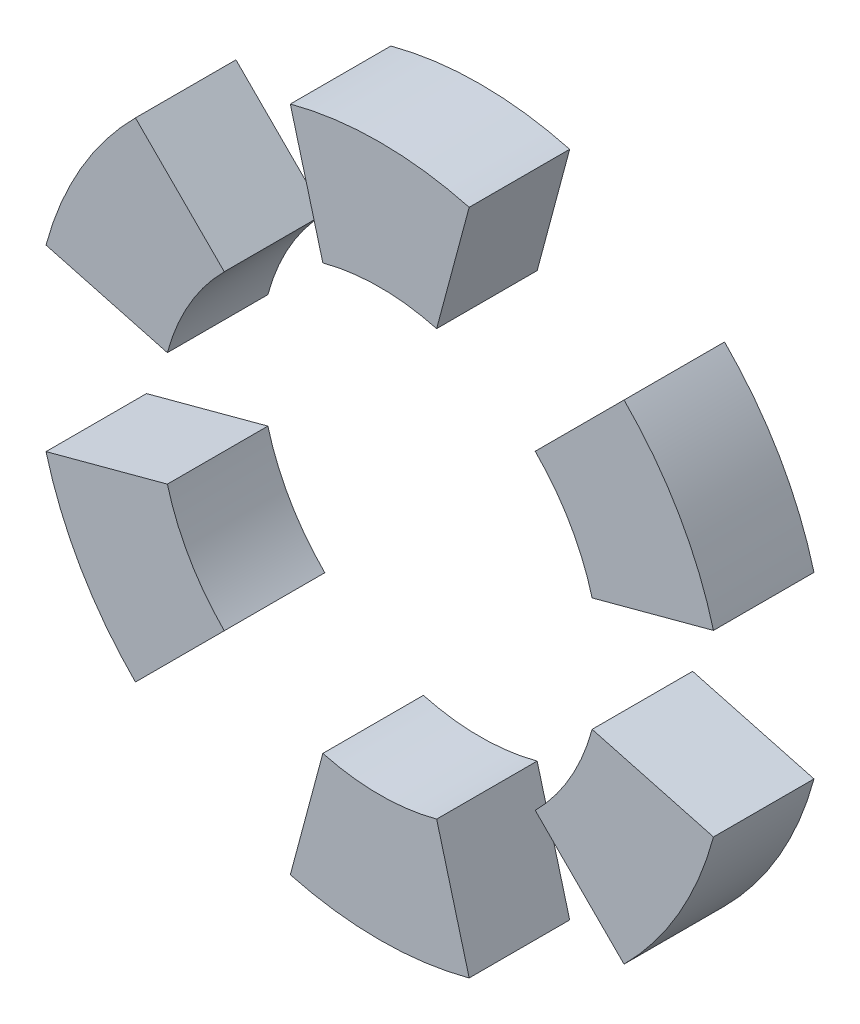
ISO-10303-21;
HEADER;
FILE_DESCRIPTION(('STEP AP214'),'2;1');
FILE_NAME('part.step','',(''),(''),'','','');
FILE_SCHEMA(('AUTOMOTIVE_DESIGN { 1 0 10303 214 1 1 1 1 }'));
ENDSEC;
DATA;
#1=APPLICATION_CONTEXT('core data for automotive mechanical design processes');
#2=APPLICATION_PROTOCOL_DEFINITION('international standard','automotive_design',2000,#1);
#3=PRODUCT_CONTEXT('',#1,'mechanical');
#4=PRODUCT('Part','Part','',(#3));
#5=PRODUCT_RELATED_PRODUCT_CATEGORY('part','',(#4));
#6=PRODUCT_DEFINITION_FORMATION('','',#4);
#7=PRODUCT_DEFINITION_CONTEXT('part definition',#1,'design');
#8=PRODUCT_DEFINITION('design','',#6,#7);
#9=PRODUCT_DEFINITION_SHAPE('','',#8);
#10=(LENGTH_UNIT() NAMED_UNIT(*) SI_UNIT(.MILLI.,.METRE.));
#11=(NAMED_UNIT(*) PLANE_ANGLE_UNIT() SI_UNIT($,.RADIAN.));
#12=(NAMED_UNIT(*) SI_UNIT($,.STERADIAN.) SOLID_ANGLE_UNIT());
#13=UNCERTAINTY_MEASURE_WITH_UNIT(LENGTH_MEASURE(1.E-05),#10,'distance_accuracy_value','');
#14=(GEOMETRIC_REPRESENTATION_CONTEXT(3) GLOBAL_UNCERTAINTY_ASSIGNED_CONTEXT((#13)) GLOBAL_UNIT_ASSIGNED_CONTEXT((#10,
#11,#12)) REPRESENTATION_CONTEXT('',''));
#15=CARTESIAN_POINT('',(0.,0.,0.));
#16=DIRECTION('',(0.,0.,1.));
#17=DIRECTION('',(1.,0.,0.));
#18=AXIS2_PLACEMENT_3D('',#15,#16,#17);
#19=CARTESIAN_POINT('',(0.,0.,8.));
#20=DIRECTION('',(0.,0.,-1.));
#21=DIRECTION('',(-1.,0.,0.));
#22=AXIS2_PLACEMENT_3D('',#19,#20,#21);
#23=CYLINDRICAL_SURFACE('',#22,27.5);
#24=CARTESIAN_POINT('',(0.,0.,0.));
#25=DIRECTION('',(0.,0.,1.));
#26=DIRECTION('',(1.,0.,0.));
#27=AXIS2_PLACEMENT_3D('',#24,#25,#26);
#28=CIRCLE('',#27,27.5);
#29=CARTESIAN_POINT('',(-7.11752374031982,-26.5629602229492,0.));
#30=VERTEX_POINT('',#29);
#31=CARTESIAN_POINT('',(7.11752374031886,-26.5629602229495,0.));
#32=VERTEX_POINT('',#31);
#33=EDGE_CURVE('E113',#30,#32,#28,.T.);
#34=ORIENTED_EDGE('',*,*,#33,.T.);
#35=DIRECTION('',(0.,0.,-1.));
#36=VECTOR('',#35,1.);
#37=CARTESIAN_POINT('',(7.11752374031886,-26.5629602229495,8.));
#38=LINE('',#37,#36);
#39=CARTESIAN_POINT('',(7.11752374031886,-26.5629602229495,8.));
#40=VERTEX_POINT('',#39);
#41=EDGE_CURVE('E12',#40,#32,#38,.T.);
#42=ORIENTED_EDGE('',*,*,#41,.F.);
#43=CARTESIAN_POINT('',(0.,0.,8.));
#44=DIRECTION('',(0.,0.,1.));
#45=DIRECTION('',(1.,0.,0.));
#46=AXIS2_PLACEMENT_3D('',#43,#44,#45);
#47=CIRCLE('',#46,27.5);
#48=CARTESIAN_POINT('',(-7.11752374031982,-26.5629602229492,8.));
#49=VERTEX_POINT('',#48);
#50=EDGE_CURVE('E101',#49,#40,#47,.T.);
#51=ORIENTED_EDGE('',*,*,#50,.F.);
#52=DIRECTION('',(0.,0.,-1.));
#53=VECTOR('',#52,1.);
#54=CARTESIAN_POINT('',(-7.11752374031982,-26.5629602229492,8.));
#55=LINE('',#54,#53);
#56=EDGE_CURVE('E109',#49,#30,#55,.T.);
#57=ORIENTED_EDGE('',*,*,#56,.T.);
#58=EDGE_LOOP('',(#34,#42,#51,#57));
#59=FACE_BOUND('',#58,.T.);
#60=ADVANCED_FACE('F50',(#59),#23,.T.);
#61=CARTESIAN_POINT('',(4.52933328929371,-16.9037019600588,8.));
#62=DIRECTION('',(-0.96592582628907,-0.258819045102515,0.));
#63=DIRECTION('',(0.258819045102515,-0.96592582628907,0.));
#64=AXIS2_PLACEMENT_3D('',#61,#62,#63);
#65=PLANE('',#64);
#66=DIRECTION('',(-0.258819045102515,0.96592582628907,0.));
#67=VECTOR('',#66,1.);
#68=CARTESIAN_POINT('',(4.52933328929371,-16.9037019600588,0.));
#69=LINE('',#68,#67);
#70=CARTESIAN_POINT('',(4.52933328929371,-16.9037019600588,0.));
#71=VERTEX_POINT('',#70);
#72=EDGE_CURVE('E105',#32,#71,#69,.T.);
#73=ORIENTED_EDGE('',*,*,#72,.T.);
#74=DIRECTION('',(0.,0.,-1.));
#75=VECTOR('',#74,1.);
#76=CARTESIAN_POINT('',(4.52933328929371,-16.9037019600588,8.));
#77=LINE('',#76,#75);
#78=CARTESIAN_POINT('',(4.52933328929371,-16.9037019600588,8.));
#79=VERTEX_POINT('',#78);
#80=EDGE_CURVE('E58',#79,#71,#77,.T.);
#81=ORIENTED_EDGE('',*,*,#80,.F.);
#82=DIRECTION('',(-0.258819045102515,0.96592582628907,0.));
#83=VECTOR('',#82,1.);
#84=CARTESIAN_POINT('',(4.52933328929371,-16.9037019600588,8.));
#85=LINE('',#84,#83);
#86=EDGE_CURVE('E96',#40,#79,#85,.T.);
#87=ORIENTED_EDGE('',*,*,#86,.F.);
#88=ORIENTED_EDGE('',*,*,#41,.T.);
#89=EDGE_LOOP('',(#73,#81,#87,#88));
#90=FACE_BOUND('',#89,.T.);
#91=ADVANCED_FACE('F104',(#90),#65,.F.);
#92=CARTESIAN_POINT('',(0.,0.,8.));
#93=DIRECTION('',(0.,0.,-1.));
#94=DIRECTION('',(-1.,0.,0.));
#95=AXIS2_PLACEMENT_3D('',#92,#93,#94);
#96=CYLINDRICAL_SURFACE('',#95,17.5);
#97=CARTESIAN_POINT('',(0.,0.,0.));
#98=DIRECTION('',(0.,0.,-1.));
#99=DIRECTION('',(1.,0.,0.));
#100=AXIS2_PLACEMENT_3D('',#97,#98,#99);
#101=CIRCLE('',#100,17.5);
#102=CARTESIAN_POINT('',(-4.52933328929454,-16.9037019600586,0.));
#103=VERTEX_POINT('',#102);
#104=EDGE_CURVE('E83',#71,#103,#101,.T.);
#105=ORIENTED_EDGE('',*,*,#104,.T.);
#106=DIRECTION('',(0.,0.,-1.));
#107=VECTOR('',#106,1.);
#108=CARTESIAN_POINT('',(-4.52933328929454,-16.9037019600586,8.));
#109=LINE('',#108,#107);
#110=CARTESIAN_POINT('',(-4.52933328929454,-16.9037019600586,8.));
#111=VERTEX_POINT('',#110);
#112=EDGE_CURVE('E106',#111,#103,#109,.T.);
#113=ORIENTED_EDGE('',*,*,#112,.F.);
#114=CARTESIAN_POINT('',(0.,0.,8.));
#115=DIRECTION('',(0.,0.,-1.));
#116=DIRECTION('',(1.,0.,0.));
#117=AXIS2_PLACEMENT_3D('',#114,#115,#116);
#118=CIRCLE('',#117,17.5);
#119=EDGE_CURVE('E99',#79,#111,#118,.T.);
#120=ORIENTED_EDGE('',*,*,#119,.F.);
#121=ORIENTED_EDGE('',*,*,#80,.T.);
#122=EDGE_LOOP('',(#105,#113,#120,#121));
#123=FACE_BOUND('',#122,.T.);
#124=ADVANCED_FACE('F107',(#123),#96,.F.);
#125=CARTESIAN_POINT('',(-4.52933328929454,-16.9037019600586,8.));
#126=DIRECTION('',(0.965925826289066,-0.258819045102528,0.));
#127=DIRECTION('',(0.258819045102528,0.965925826289066,0.));
#128=AXIS2_PLACEMENT_3D('',#125,#126,#127);
#129=PLANE('',#128);
#130=DIRECTION('',(-0.258819045102528,-0.965925826289066,0.));
#131=VECTOR('',#130,1.);
#132=CARTESIAN_POINT('',(-4.52933328929454,-16.9037019600586,0.));
#133=LINE('',#132,#131);
#134=EDGE_CURVE('E89',#103,#30,#133,.T.);
#135=ORIENTED_EDGE('',*,*,#134,.T.);
#136=ORIENTED_EDGE('',*,*,#56,.F.);
#137=DIRECTION('',(-0.258819045102528,-0.965925826289066,0.));
#138=VECTOR('',#137,1.);
#139=CARTESIAN_POINT('',(-4.52933328929454,-16.9037019600586,8.));
#140=LINE('',#139,#138);
#141=EDGE_CURVE('E66',#111,#49,#140,.T.);
#142=ORIENTED_EDGE('',*,*,#141,.F.);
#143=ORIENTED_EDGE('',*,*,#112,.T.);
#144=EDGE_LOOP('',(#135,#136,#142,#143));
#145=FACE_BOUND('',#144,.T.);
#146=ADVANCED_FACE('F120',(#145),#129,.F.);
#147=CARTESIAN_POINT('',(0.,0.,8.));
#148=DIRECTION('',(0.,0.,1.));
#149=DIRECTION('',(1.,0.,0.));
#150=AXIS2_PLACEMENT_3D('',#147,#148,#149);
#151=PLANE('',#150);
#152=ORIENTED_EDGE('',*,*,#50,.T.);
#153=ORIENTED_EDGE('',*,*,#86,.T.);
#154=ORIENTED_EDGE('',*,*,#119,.T.);
#155=ORIENTED_EDGE('',*,*,#141,.T.);
#156=EDGE_LOOP('',(#152,#153,#154,#155));
#157=FACE_BOUND('',#156,.T.);
#158=ADVANCED_FACE('F97',(#157),#151,.T.);
#159=CARTESIAN_POINT('',(0.,0.,0.));
#160=DIRECTION('',(0.,0.,1.));
#161=DIRECTION('',(1.,0.,0.));
#162=AXIS2_PLACEMENT_3D('',#159,#160,#161);
#163=PLANE('',#162);
#164=ORIENTED_EDGE('',*,*,#33,.F.);
#165=ORIENTED_EDGE('',*,*,#134,.F.);
#166=ORIENTED_EDGE('',*,*,#104,.F.);
#167=ORIENTED_EDGE('',*,*,#72,.F.);
#168=EDGE_LOOP('',(#164,#165,#166,#167));
#169=FACE_BOUND('',#168,.T.);
#170=ADVANCED_FACE('F123',(#169),#163,.F.);
#171=CLOSED_SHELL('',(#60,#91,#124,#146,#158,#170));
#172=MANIFOLD_SOLID_BREP('B2',#171);
#173=CARTESIAN_POINT('',(0.,0.,8.));
#174=DIRECTION('',(0.,0.,-1.));
#175=DIRECTION('',(-1.,0.,0.));
#176=AXIS2_PLACEMENT_3D('',#173,#174,#175);
#177=CYLINDRICAL_SURFACE('',#176,27.5);
#178=CARTESIAN_POINT('',(0.,0.,0.));
#179=DIRECTION('',(0.,0.,1.));
#180=DIRECTION('',(1.,0.,0.));
#181=AXIS2_PLACEMENT_3D('',#178,#179,#180);
#182=CIRCLE('',#181,27.5);
#183=CARTESIAN_POINT('',(19.4454364826295,-19.4454364826307,0.));
#184=VERTEX_POINT('',#183);
#185=CARTESIAN_POINT('',(26.5629602229492,-7.11752374032009,0.));
#186=VERTEX_POINT('',#185);
#187=EDGE_CURVE('E252',#184,#186,#182,.T.);
#188=ORIENTED_EDGE('',*,*,#187,.T.);
#189=DIRECTION('',(0.,0.,-1.));
#190=VECTOR('',#189,1.);
#191=CARTESIAN_POINT('',(26.5629602229492,-7.11752374032009,8.));
#192=LINE('',#191,#190);
#193=CARTESIAN_POINT('',(26.5629602229492,-7.11752374032009,8.));
#194=VERTEX_POINT('',#193);
#195=EDGE_CURVE('E48',#194,#186,#192,.T.);
#196=ORIENTED_EDGE('',*,*,#195,.F.);
#197=CARTESIAN_POINT('',(0.,0.,8.));
#198=DIRECTION('',(0.,0.,1.));
#199=DIRECTION('',(1.,0.,0.));
#200=AXIS2_PLACEMENT_3D('',#197,#198,#199);
#201=CIRCLE('',#200,27.5);
#202=CARTESIAN_POINT('',(19.4454364826295,-19.4454364826307,8.));
#203=VERTEX_POINT('',#202);
#204=EDGE_CURVE('E236',#203,#194,#201,.T.);
#205=ORIENTED_EDGE('',*,*,#204,.F.);
#206=DIRECTION('',(0.,0.,-1.));
#207=VECTOR('',#206,1.);
#208=CARTESIAN_POINT('',(19.4454364826295,-19.4454364826307,8.));
#209=LINE('',#208,#207);
#210=EDGE_CURVE('E248',#203,#184,#209,.T.);
#211=ORIENTED_EDGE('',*,*,#210,.T.);
#212=EDGE_LOOP('',(#188,#196,#205,#211));
#213=FACE_BOUND('',#212,.T.);
#214=ADVANCED_FACE('F184',(#213),#177,.T.);
#215=CARTESIAN_POINT('',(16.9037019600585,-4.52933328929472,8.));
#216=DIRECTION('',(-0.258819045102538,-0.965925826289064,0.));
#217=DIRECTION('',(0.965925826289064,-0.258819045102538,0.));
#218=AXIS2_PLACEMENT_3D('',#215,#216,#217);
#219=PLANE('',#218);
#220=DIRECTION('',(-0.965925826289064,0.258819045102538,0.));
#221=VECTOR('',#220,1.);
#222=CARTESIAN_POINT('',(16.9037019600585,-4.52933328929472,0.));
#223=LINE('',#222,#221);
#224=CARTESIAN_POINT('',(16.9037019600585,-4.52933328929471,0.));
#225=VERTEX_POINT('',#224);
#226=EDGE_CURVE('E241',#186,#225,#223,.T.);
#227=ORIENTED_EDGE('',*,*,#226,.T.);
#228=DIRECTION('',(0.,0.,-1.));
#229=VECTOR('',#228,1.);
#230=CARTESIAN_POINT('',(16.9037019600585,-4.52933328929471,8.));
#231=LINE('',#230,#229);
#232=CARTESIAN_POINT('',(16.9037019600585,-4.52933328929471,8.));
#233=VERTEX_POINT('',#232);
#234=EDGE_CURVE('E193',#233,#225,#231,.T.);
#235=ORIENTED_EDGE('',*,*,#234,.F.);
#236=DIRECTION('',(-0.965925826289064,0.258819045102538,0.));
#237=VECTOR('',#236,1.);
#238=CARTESIAN_POINT('',(16.9037019600585,-4.52933328929472,8.));
#239=LINE('',#238,#237);
#240=EDGE_CURVE('E231',#194,#233,#239,.T.);
#241=ORIENTED_EDGE('',*,*,#240,.F.);
#242=ORIENTED_EDGE('',*,*,#195,.T.);
#243=EDGE_LOOP('',(#227,#235,#241,#242));
#244=FACE_BOUND('',#243,.T.);
#245=ADVANCED_FACE('F240',(#244),#219,.F.);
#246=CARTESIAN_POINT('',(0.,0.,8.));
#247=DIRECTION('',(0.,0.,-1.));
#248=DIRECTION('',(-1.,0.,0.));
#249=AXIS2_PLACEMENT_3D('',#246,#247,#248);
#250=CYLINDRICAL_SURFACE('',#249,17.5);
#251=CARTESIAN_POINT('',(0.,0.,0.));
#252=DIRECTION('',(0.,0.,-1.));
#253=DIRECTION('',(1.,0.,0.));
#254=AXIS2_PLACEMENT_3D('',#251,#252,#253);
#255=CIRCLE('',#254,17.5);
#256=CARTESIAN_POINT('',(12.3743686707641,-12.374368670765,0.));
#257=VERTEX_POINT('',#256);
#258=EDGE_CURVE('E218',#225,#257,#255,.T.);
#259=ORIENTED_EDGE('',*,*,#258,.T.);
#260=DIRECTION('',(0.,0.,-1.));
#261=VECTOR('',#260,1.);
#262=CARTESIAN_POINT('',(12.3743686707641,-12.374368670765,8.));
#263=LINE('',#262,#261);
#264=CARTESIAN_POINT('',(12.3743686707641,-12.374368670765,8.));
#265=VERTEX_POINT('',#264);
#266=EDGE_CURVE('E243',#265,#257,#263,.T.);
#267=ORIENTED_EDGE('',*,*,#266,.F.);
#268=CARTESIAN_POINT('',(0.,0.,8.));
#269=DIRECTION('',(0.,0.,-1.));
#270=DIRECTION('',(1.,0.,0.));
#271=AXIS2_PLACEMENT_3D('',#268,#269,#270);
#272=CIRCLE('',#271,17.5);
#273=EDGE_CURVE('E234',#233,#265,#272,.T.);
#274=ORIENTED_EDGE('',*,*,#273,.F.);
#275=ORIENTED_EDGE('',*,*,#234,.T.);
#276=EDGE_LOOP('',(#259,#267,#274,#275));
#277=FACE_BOUND('',#276,.T.);
#278=ADVANCED_FACE('F244',(#277),#250,.F.);
#279=CARTESIAN_POINT('',(12.3743686707641,-12.374368670765,8.));
#280=DIRECTION('',(0.707106781186561,0.707106781186534,0.));
#281=DIRECTION('',(-0.707106781186534,0.707106781186561,0.));
#282=AXIS2_PLACEMENT_3D('',#279,#280,#281);
#283=PLANE('',#282);
#284=DIRECTION('',(0.707106781186534,-0.707106781186561,0.));
#285=VECTOR('',#284,1.);
#286=CARTESIAN_POINT('',(12.3743686707641,-12.374368670765,0.));
#287=LINE('',#286,#285);
#288=EDGE_CURVE('E224',#257,#184,#287,.T.);
#289=ORIENTED_EDGE('',*,*,#288,.T.);
#290=ORIENTED_EDGE('',*,*,#210,.F.);
#291=DIRECTION('',(0.707106781186534,-0.707106781186561,0.));
#292=VECTOR('',#291,1.);
#293=CARTESIAN_POINT('',(12.3743686707641,-12.374368670765,8.));
#294=LINE('',#293,#292);
#295=EDGE_CURVE('E201',#265,#203,#294,.T.);
#296=ORIENTED_EDGE('',*,*,#295,.F.);
#297=ORIENTED_EDGE('',*,*,#266,.T.);
#298=EDGE_LOOP('',(#289,#290,#296,#297));
#299=FACE_BOUND('',#298,.T.);
#300=ADVANCED_FACE('F265',(#299),#283,.F.);
#301=CARTESIAN_POINT('',(0.,0.,8.));
#302=DIRECTION('',(0.,0.,1.));
#303=DIRECTION('',(1.,0.,0.));
#304=AXIS2_PLACEMENT_3D('',#301,#302,#303);
#305=PLANE('',#304);
#306=ORIENTED_EDGE('',*,*,#204,.T.);
#307=ORIENTED_EDGE('',*,*,#240,.T.);
#308=ORIENTED_EDGE('',*,*,#273,.T.);
#309=ORIENTED_EDGE('',*,*,#295,.T.);
#310=EDGE_LOOP('',(#306,#307,#308,#309));
#311=FACE_BOUND('',#310,.T.);
#312=ADVANCED_FACE('F232',(#311),#305,.T.);
#313=CARTESIAN_POINT('',(0.,0.,0.));
#314=DIRECTION('',(0.,0.,1.));
#315=DIRECTION('',(1.,0.,0.));
#316=AXIS2_PLACEMENT_3D('',#313,#314,#315);
#317=PLANE('',#316);
#318=ORIENTED_EDGE('',*,*,#187,.F.);
#319=ORIENTED_EDGE('',*,*,#288,.F.);
#320=ORIENTED_EDGE('',*,*,#258,.F.);
#321=ORIENTED_EDGE('',*,*,#226,.F.);
#322=EDGE_LOOP('',(#318,#319,#320,#321));
#323=FACE_BOUND('',#322,.T.);
#324=ADVANCED_FACE('F268',(#323),#317,.F.);
#325=CLOSED_SHELL('',(#214,#245,#278,#300,#312,#324));
#326=MANIFOLD_SOLID_BREP('B6',#325);
#327=CARTESIAN_POINT('',(0.,0.,8.));
#328=DIRECTION('',(0.,0.,-1.));
#329=DIRECTION('',(-1.,0.,0.));
#330=AXIS2_PLACEMENT_3D('',#327,#328,#329);
#331=CYLINDRICAL_SURFACE('',#330,17.5);
#332=CARTESIAN_POINT('',(0.,0.,0.));
#333=DIRECTION('',(0.,0.,-1.));
#334=DIRECTION('',(1.,0.,0.));
#335=AXIS2_PLACEMENT_3D('',#332,#333,#334);
#336=CIRCLE('',#335,17.5);
#337=CARTESIAN_POINT('',(-12.3743686707649,-12.3743686707643,0.));
#338=VERTEX_POINT('',#337);
#339=CARTESIAN_POINT('',(-16.9037019600588,-4.52933328929365,0.));
#340=VERTEX_POINT('',#339);
#341=EDGE_CURVE('E393',#338,#340,#336,.T.);
#342=ORIENTED_EDGE('',*,*,#341,.T.);
#343=DIRECTION('',(0.,0.,-1.));
#344=VECTOR('',#343,1.);
#345=CARTESIAN_POINT('',(-16.9037019600588,-4.52933328929365,8.));
#346=LINE('',#345,#344);
#347=CARTESIAN_POINT('',(-16.9037019600588,-4.52933328929365,8.));
#348=VERTEX_POINT('',#347);
#349=EDGE_CURVE('E182',#348,#340,#346,.T.);
#350=ORIENTED_EDGE('',*,*,#349,.F.);
#351=CARTESIAN_POINT('',(0.,0.,8.));
#352=DIRECTION('',(0.,0.,-1.));
#353=DIRECTION('',(1.,0.,0.));
#354=AXIS2_PLACEMENT_3D('',#351,#352,#353);
#355=CIRCLE('',#354,17.5);
#356=CARTESIAN_POINT('',(-12.3743686707649,-12.3743686707643,8.));
#357=VERTEX_POINT('',#356);
#358=EDGE_CURVE('E381',#357,#348,#355,.T.);
#359=ORIENTED_EDGE('',*,*,#358,.F.);
#360=DIRECTION('',(0.,0.,-1.));
#361=VECTOR('',#360,1.);
#362=CARTESIAN_POINT('',(-12.3743686707649,-12.3743686707643,8.));
#363=LINE('',#362,#361);
#364=EDGE_CURVE('E389',#357,#338,#363,.T.);
#365=ORIENTED_EDGE('',*,*,#364,.T.);
#366=EDGE_LOOP('',(#342,#350,#359,#365));
#367=FACE_BOUND('',#366,.T.);
#368=ADVANCED_FACE('F330',(#367),#331,.F.);
#369=CARTESIAN_POINT('',(-16.9037019600588,-4.52933328929365,8.));
#370=DIRECTION('',(0.258819045102511,-0.965925826289071,0.));
#371=DIRECTION('',(0.965925826289071,0.258819045102511,0.));
#372=AXIS2_PLACEMENT_3D('',#369,#370,#371);
#373=PLANE('',#372);
#374=DIRECTION('',(-0.965925826289071,-0.258819045102511,0.));
#375=VECTOR('',#374,1.);
#376=CARTESIAN_POINT('',(-16.9037019600588,-4.52933328929365,0.));
#377=LINE('',#376,#375);
#378=CARTESIAN_POINT('',(-26.5629602229495,-7.11752374031876,0.));
#379=VERTEX_POINT('',#378);
#380=EDGE_CURVE('E385',#340,#379,#377,.T.);
#381=ORIENTED_EDGE('',*,*,#380,.T.);
#382=DIRECTION('',(0.,0.,-1.));
#383=VECTOR('',#382,1.);
#384=CARTESIAN_POINT('',(-26.5629602229495,-7.11752374031876,8.));
#385=LINE('',#384,#383);
#386=CARTESIAN_POINT('',(-26.5629602229495,-7.11752374031876,8.));
#387=VERTEX_POINT('',#386);
#388=EDGE_CURVE('E338',#387,#379,#385,.T.);
#389=ORIENTED_EDGE('',*,*,#388,.F.);
#390=DIRECTION('',(-0.965925826289071,-0.258819045102511,0.));
#391=VECTOR('',#390,1.);
#392=CARTESIAN_POINT('',(-16.9037019600588,-4.52933328929365,8.));
#393=LINE('',#392,#391);
#394=EDGE_CURVE('E376',#348,#387,#393,.T.);
#395=ORIENTED_EDGE('',*,*,#394,.F.);
#396=ORIENTED_EDGE('',*,*,#349,.T.);
#397=EDGE_LOOP('',(#381,#389,#395,#396));
#398=FACE_BOUND('',#397,.T.);
#399=ADVANCED_FACE('F384',(#398),#373,.F.);
#400=CARTESIAN_POINT('',(0.,0.,8.));
#401=DIRECTION('',(0.,0.,-1.));
#402=DIRECTION('',(-1.,0.,0.));
#403=AXIS2_PLACEMENT_3D('',#400,#401,#402);
#404=CYLINDRICAL_SURFACE('',#403,27.5);
#405=CARTESIAN_POINT('',(0.,0.,0.));
#406=DIRECTION('',(0.,0.,1.));
#407=DIRECTION('',(1.,0.,0.));
#408=AXIS2_PLACEMENT_3D('',#405,#406,#407);
#409=CIRCLE('',#408,27.5);
#410=CARTESIAN_POINT('',(-19.4454364826305,-19.4454364826297,0.));
#411=VERTEX_POINT('',#410);
#412=EDGE_CURVE('E363',#379,#411,#409,.T.);
#413=ORIENTED_EDGE('',*,*,#412,.T.);
#414=DIRECTION('',(0.,0.,-1.));
#415=VECTOR('',#414,1.);
#416=CARTESIAN_POINT('',(-19.4454364826305,-19.4454364826297,8.));
#417=LINE('',#416,#415);
#418=CARTESIAN_POINT('',(-19.4454364826305,-19.4454364826297,8.));
#419=VERTEX_POINT('',#418);
#420=EDGE_CURVE('E386',#419,#411,#417,.T.);
#421=ORIENTED_EDGE('',*,*,#420,.F.);
#422=CARTESIAN_POINT('',(0.,0.,8.));
#423=DIRECTION('',(0.,0.,1.));
#424=DIRECTION('',(1.,0.,0.));
#425=AXIS2_PLACEMENT_3D('',#422,#423,#424);
#426=CIRCLE('',#425,27.5);
#427=EDGE_CURVE('E379',#387,#419,#426,.T.);
#428=ORIENTED_EDGE('',*,*,#427,.F.);
#429=ORIENTED_EDGE('',*,*,#388,.T.);
#430=EDGE_LOOP('',(#413,#421,#428,#429));
#431=FACE_BOUND('',#430,.T.);
#432=ADVANCED_FACE('F387',(#431),#404,.T.);
#433=CARTESIAN_POINT('',(-12.3743686707649,-12.3743686707643,8.));
#434=DIRECTION('',(-0.707106781186542,0.707106781186554,0.));
#435=DIRECTION('',(-0.707106781186554,-0.707106781186542,0.));
#436=AXIS2_PLACEMENT_3D('',#433,#434,#435);
#437=PLANE('',#436);
#438=DIRECTION('',(0.707106781186553,0.707106781186542,0.));
#439=VECTOR('',#438,1.);
#440=CARTESIAN_POINT('',(-12.3743686707649,-12.3743686707643,0.));
#441=LINE('',#440,#439);
#442=EDGE_CURVE('E369',#411,#338,#441,.T.);
#443=ORIENTED_EDGE('',*,*,#442,.T.);
#444=ORIENTED_EDGE('',*,*,#364,.F.);
#445=DIRECTION('',(0.707106781186553,0.707106781186542,0.));
#446=VECTOR('',#445,1.);
#447=CARTESIAN_POINT('',(-12.3743686707649,-12.3743686707643,8.));
#448=LINE('',#447,#446);
#449=EDGE_CURVE('E346',#419,#357,#448,.T.);
#450=ORIENTED_EDGE('',*,*,#449,.F.);
#451=ORIENTED_EDGE('',*,*,#420,.T.);
#452=EDGE_LOOP('',(#443,#444,#450,#451));
#453=FACE_BOUND('',#452,.T.);
#454=ADVANCED_FACE('F400',(#453),#437,.F.);
#455=CARTESIAN_POINT('',(0.,0.,8.));
#456=DIRECTION('',(0.,0.,1.));
#457=DIRECTION('',(1.,0.,0.));
#458=AXIS2_PLACEMENT_3D('',#455,#456,#457);
#459=PLANE('',#458);
#460=ORIENTED_EDGE('',*,*,#358,.T.);
#461=ORIENTED_EDGE('',*,*,#394,.T.);
#462=ORIENTED_EDGE('',*,*,#427,.T.);
#463=ORIENTED_EDGE('',*,*,#449,.T.);
#464=EDGE_LOOP('',(#460,#461,#462,#463));
#465=FACE_BOUND('',#464,.T.);
#466=ADVANCED_FACE('F377',(#465),#459,.T.);
#467=CARTESIAN_POINT('',(0.,0.,0.));
#468=DIRECTION('',(0.,0.,1.));
#469=DIRECTION('',(1.,0.,0.));
#470=AXIS2_PLACEMENT_3D('',#467,#468,#469);
#471=PLANE('',#470);
#472=ORIENTED_EDGE('',*,*,#341,.F.);
#473=ORIENTED_EDGE('',*,*,#442,.F.);
#474=ORIENTED_EDGE('',*,*,#412,.F.);
#475=ORIENTED_EDGE('',*,*,#380,.F.);
#476=EDGE_LOOP('',(#472,#473,#474,#475));
#477=FACE_BOUND('',#476,.T.);
#478=ADVANCED_FACE('F403',(#477),#471,.F.);
#479=CLOSED_SHELL('',(#368,#399,#432,#454,#466,#478));
#480=MANIFOLD_SOLID_BREP('B42',#479);
#481=CARTESIAN_POINT('',(0.,0.,8.));
#482=DIRECTION('',(0.,0.,-1.));
#483=DIRECTION('',(-1.,0.,0.));
#484=AXIS2_PLACEMENT_3D('',#481,#482,#483);
#485=CYLINDRICAL_SURFACE('',#484,27.5);
#486=CARTESIAN_POINT('',(0.,0.,0.));
#487=DIRECTION('',(0.,0.,1.));
#488=DIRECTION('',(1.,0.,0.));
#489=AXIS2_PLACEMENT_3D('',#486,#487,#488);
#490=CIRCLE('',#489,27.5);
#491=CARTESIAN_POINT('',(26.5629602229496,7.11752374031857,0.));
#492=VERTEX_POINT('',#491);
#493=CARTESIAN_POINT('',(19.4454364826306,19.4454364826295,0.));
#494=VERTEX_POINT('',#493);
#495=EDGE_CURVE('E527',#492,#494,#490,.T.);
#496=ORIENTED_EDGE('',*,*,#495,.T.);
#497=DIRECTION('',(0.,0.,-1.));
#498=VECTOR('',#497,1.);
#499=CARTESIAN_POINT('',(19.4454364826306,19.4454364826295,8.));
#500=LINE('',#499,#498);
#501=CARTESIAN_POINT('',(19.4454364826306,19.4454364826295,8.));
#502=VERTEX_POINT('',#501);
#503=EDGE_CURVE('E328',#502,#494,#500,.T.);
#504=ORIENTED_EDGE('',*,*,#503,.F.);
#505=CARTESIAN_POINT('',(0.,0.,8.));
#506=DIRECTION('',(0.,0.,1.));
#507=DIRECTION('',(1.,0.,0.));
#508=AXIS2_PLACEMENT_3D('',#505,#506,#507);
#509=CIRCLE('',#508,27.5);
#510=CARTESIAN_POINT('',(26.5629602229496,7.11752374031857,8.));
#511=VERTEX_POINT('',#510);
#512=EDGE_CURVE('E515',#511,#502,#509,.T.);
#513=ORIENTED_EDGE('',*,*,#512,.F.);
#514=DIRECTION('',(0.,0.,-1.));
#515=VECTOR('',#514,1.);
#516=CARTESIAN_POINT('',(26.5629602229496,7.11752374031857,8.));
#517=LINE('',#516,#515);
#518=EDGE_CURVE('E523',#511,#492,#517,.T.);
#519=ORIENTED_EDGE('',*,*,#518,.T.);
#520=EDGE_LOOP('',(#496,#504,#513,#519));
#521=FACE_BOUND('',#520,.T.);
#522=ADVANCED_FACE('F464',(#521),#485,.T.);
#523=CARTESIAN_POINT('',(12.374368670765,12.3743686707642,8.));
#524=DIRECTION('',(0.707106781186537,-0.707106781186558,0.));
#525=DIRECTION('',(0.707106781186558,0.707106781186537,0.));
#526=AXIS2_PLACEMENT_3D('',#523,#524,#525);
#527=PLANE('',#526);
#528=DIRECTION('',(-0.707106781186558,-0.707106781186537,0.));
#529=VECTOR('',#528,1.);
#530=CARTESIAN_POINT('',(12.374368670765,12.3743686707642,0.));
#531=LINE('',#530,#529);
#532=CARTESIAN_POINT('',(12.374368670765,12.3743686707642,0.));
#533=VERTEX_POINT('',#532);
#534=EDGE_CURVE('E519',#494,#533,#531,.T.);
#535=ORIENTED_EDGE('',*,*,#534,.T.);
#536=DIRECTION('',(0.,0.,-1.));
#537=VECTOR('',#536,1.);
#538=CARTESIAN_POINT('',(12.374368670765,12.3743686707642,8.));
#539=LINE('',#538,#537);
#540=CARTESIAN_POINT('',(12.374368670765,12.3743686707642,8.));
#541=VERTEX_POINT('',#540);
#542=EDGE_CURVE('E472',#541,#533,#539,.T.);
#543=ORIENTED_EDGE('',*,*,#542,.F.);
#544=DIRECTION('',(-0.707106781186558,-0.707106781186537,0.));
#545=VECTOR('',#544,1.);
#546=CARTESIAN_POINT('',(12.374368670765,12.3743686707642,8.));
#547=LINE('',#546,#545);
#548=EDGE_CURVE('E510',#502,#541,#547,.T.);
#549=ORIENTED_EDGE('',*,*,#548,.F.);
#550=ORIENTED_EDGE('',*,*,#503,.T.);
#551=EDGE_LOOP('',(#535,#543,#549,#550));
#552=FACE_BOUND('',#551,.T.);
#553=ADVANCED_FACE('F518',(#552),#527,.F.);
#554=CARTESIAN_POINT('',(0.,0.,8.));
#555=DIRECTION('',(0.,0.,-1.));
#556=DIRECTION('',(-1.,0.,0.));
#557=AXIS2_PLACEMENT_3D('',#554,#555,#556);
#558=CYLINDRICAL_SURFACE('',#557,17.5);
#559=CARTESIAN_POINT('',(0.,0.,0.));
#560=DIRECTION('',(0.,0.,-1.));
#561=DIRECTION('',(1.,0.,0.));
#562=AXIS2_PLACEMENT_3D('',#559,#560,#561);
#563=CIRCLE('',#562,17.5);
#564=CARTESIAN_POINT('',(16.9037019600589,4.52933328929352,0.));
#565=VERTEX_POINT('',#564);
#566=EDGE_CURVE('E497',#533,#565,#563,.T.);
#567=ORIENTED_EDGE('',*,*,#566,.T.);
#568=DIRECTION('',(0.,0.,-1.));
#569=VECTOR('',#568,1.);
#570=CARTESIAN_POINT('',(16.9037019600589,4.52933328929352,8.));
#571=LINE('',#570,#569);
#572=CARTESIAN_POINT('',(16.9037019600589,4.52933328929352,8.));
#573=VERTEX_POINT('',#572);
#574=EDGE_CURVE('E520',#573,#565,#571,.T.);
#575=ORIENTED_EDGE('',*,*,#574,.F.);
#576=CARTESIAN_POINT('',(0.,0.,8.));
#577=DIRECTION('',(0.,0.,-1.));
#578=DIRECTION('',(1.,0.,0.));
#579=AXIS2_PLACEMENT_3D('',#576,#577,#578);
#580=CIRCLE('',#579,17.5);
#581=EDGE_CURVE('E513',#541,#573,#580,.T.);
#582=ORIENTED_EDGE('',*,*,#581,.F.);
#583=ORIENTED_EDGE('',*,*,#542,.T.);
#584=EDGE_LOOP('',(#567,#575,#582,#583));
#585=FACE_BOUND('',#584,.T.);
#586=ADVANCED_FACE('F521',(#585),#558,.F.);
#587=CARTESIAN_POINT('',(16.9037019600589,4.52933328929352,8.));
#588=DIRECTION('',(-0.258819045102504,0.965925826289073,0.));
#589=DIRECTION('',(-0.965925826289073,-0.258819045102504,0.));
#590=AXIS2_PLACEMENT_3D('',#587,#588,#589);
#591=PLANE('',#590);
#592=DIRECTION('',(0.965925826289073,0.258819045102504,0.));
#593=VECTOR('',#592,1.);
#594=CARTESIAN_POINT('',(16.9037019600589,4.52933328929352,0.));
#595=LINE('',#594,#593);
#596=EDGE_CURVE('E503',#565,#492,#595,.T.);
#597=ORIENTED_EDGE('',*,*,#596,.T.);
#598=ORIENTED_EDGE('',*,*,#518,.F.);
#599=DIRECTION('',(0.965925826289073,0.258819045102504,0.));
#600=VECTOR('',#599,1.);
#601=CARTESIAN_POINT('',(16.9037019600589,4.52933328929352,8.));
#602=LINE('',#601,#600);
#603=EDGE_CURVE('E480',#573,#511,#602,.T.);
#604=ORIENTED_EDGE('',*,*,#603,.F.);
#605=ORIENTED_EDGE('',*,*,#574,.T.);
#606=EDGE_LOOP('',(#597,#598,#604,#605));
#607=FACE_BOUND('',#606,.T.);
#608=ADVANCED_FACE('F534',(#607),#591,.F.);
#609=CARTESIAN_POINT('',(0.,0.,8.));
#610=DIRECTION('',(0.,0.,1.));
#611=DIRECTION('',(1.,0.,0.));
#612=AXIS2_PLACEMENT_3D('',#609,#610,#611);
#613=PLANE('',#612);
#614=ORIENTED_EDGE('',*,*,#512,.T.);
#615=ORIENTED_EDGE('',*,*,#548,.T.);
#616=ORIENTED_EDGE('',*,*,#581,.T.);
#617=ORIENTED_EDGE('',*,*,#603,.T.);
#618=EDGE_LOOP('',(#614,#615,#616,#617));
#619=FACE_BOUND('',#618,.T.);
#620=ADVANCED_FACE('F511',(#619),#613,.T.);
#621=CARTESIAN_POINT('',(0.,0.,0.));
#622=DIRECTION('',(0.,0.,1.));
#623=DIRECTION('',(1.,0.,0.));
#624=AXIS2_PLACEMENT_3D('',#621,#622,#623);
#625=PLANE('',#624);
#626=ORIENTED_EDGE('',*,*,#495,.F.);
#627=ORIENTED_EDGE('',*,*,#596,.F.);
#628=ORIENTED_EDGE('',*,*,#566,.F.);
#629=ORIENTED_EDGE('',*,*,#534,.F.);
#630=EDGE_LOOP('',(#626,#627,#628,#629));
#631=FACE_BOUND('',#630,.T.);
#632=ADVANCED_FACE('F537',(#631),#625,.F.);
#633=CLOSED_SHELL('',(#522,#553,#586,#608,#620,#632));
#634=MANIFOLD_SOLID_BREP('B176',#633);
#635=CARTESIAN_POINT('',(0.,0.,8.));
#636=DIRECTION('',(0.,0.,-1.));
#637=DIRECTION('',(-1.,0.,0.));
#638=AXIS2_PLACEMENT_3D('',#635,#636,#637);
#639=CYLINDRICAL_SURFACE('',#638,27.5);
#640=CARTESIAN_POINT('',(0.,0.,0.));
#641=DIRECTION('',(0.,0.,1.));
#642=DIRECTION('',(1.,0.,0.));
#643=AXIS2_PLACEMENT_3D('',#640,#641,#642);
#644=CIRCLE('',#643,27.5);
#645=CARTESIAN_POINT('',(7.11752374031964,26.5629602229493,0.));
#646=VERTEX_POINT('',#645);
#647=CARTESIAN_POINT('',(-7.11752374031904,26.5629602229495,0.));
#648=VERTEX_POINT('',#647);
#649=EDGE_CURVE('E660',#646,#648,#644,.T.);
#650=ORIENTED_EDGE('',*,*,#649,.T.);
#651=DIRECTION('',(0.,0.,-1.));
#652=VECTOR('',#651,1.);
#653=CARTESIAN_POINT('',(-7.11752374031904,26.5629602229495,8.));
#654=LINE('',#653,#652);
#655=CARTESIAN_POINT('',(-7.11752374031904,26.5629602229495,8.));
#656=VERTEX_POINT('',#655);
#657=EDGE_CURVE('E462',#656,#648,#654,.T.);
#658=ORIENTED_EDGE('',*,*,#657,.F.);
#659=CARTESIAN_POINT('',(0.,0.,8.));
#660=DIRECTION('',(0.,0.,1.));
#661=DIRECTION('',(1.,0.,0.));
#662=AXIS2_PLACEMENT_3D('',#659,#660,#661);
#663=CIRCLE('',#662,27.5);
#664=CARTESIAN_POINT('',(7.11752374031964,26.5629602229493,8.));
#665=VERTEX_POINT('',#664);
#666=EDGE_CURVE('E648',#665,#656,#663,.T.);
#667=ORIENTED_EDGE('',*,*,#666,.F.);
#668=DIRECTION('',(0.,0.,-1.));
#669=VECTOR('',#668,1.);
#670=CARTESIAN_POINT('',(7.11752374031964,26.5629602229493,8.));
#671=LINE('',#670,#669);
#672=EDGE_CURVE('E656',#665,#646,#671,.T.);
#673=ORIENTED_EDGE('',*,*,#672,.T.);
#674=EDGE_LOOP('',(#650,#658,#667,#673));
#675=FACE_BOUND('',#674,.T.);
#676=ADVANCED_FACE('F597',(#675),#639,.T.);
#677=CARTESIAN_POINT('',(-4.52933328929382,16.9037019600588,8.));
#678=DIRECTION('',(0.965925826289068,0.258819045102522,0.));
#679=DIRECTION('',(-0.258819045102522,0.965925826289068,0.));
#680=AXIS2_PLACEMENT_3D('',#677,#678,#679);
#681=PLANE('',#680);
#682=DIRECTION('',(0.258819045102522,-0.965925826289068,0.));
#683=VECTOR('',#682,1.);
#684=CARTESIAN_POINT('',(-4.52933328929382,16.9037019600588,0.));
#685=LINE('',#684,#683);
#686=CARTESIAN_POINT('',(-4.52933328929382,16.9037019600588,0.));
#687=VERTEX_POINT('',#686);
#688=EDGE_CURVE('E652',#648,#687,#685,.T.);
#689=ORIENTED_EDGE('',*,*,#688,.T.);
#690=DIRECTION('',(0.,0.,-1.));
#691=VECTOR('',#690,1.);
#692=CARTESIAN_POINT('',(-4.52933328929382,16.9037019600588,8.));
#693=LINE('',#692,#691);
#694=CARTESIAN_POINT('',(-4.52933328929382,16.9037019600588,8.));
#695=VERTEX_POINT('',#694);
#696=EDGE_CURVE('E605',#695,#687,#693,.T.);
#697=ORIENTED_EDGE('',*,*,#696,.F.);
#698=DIRECTION('',(0.258819045102522,-0.965925826289068,0.));
#699=VECTOR('',#698,1.);
#700=CARTESIAN_POINT('',(-4.52933328929382,16.9037019600588,8.));
#701=LINE('',#700,#699);
#702=EDGE_CURVE('E643',#656,#695,#701,.T.);
#703=ORIENTED_EDGE('',*,*,#702,.F.);
#704=ORIENTED_EDGE('',*,*,#657,.T.);
#705=EDGE_LOOP('',(#689,#697,#703,#704));
#706=FACE_BOUND('',#705,.T.);
#707=ADVANCED_FACE('F651',(#706),#681,.F.);
#708=CARTESIAN_POINT('',(0.,0.,8.));
#709=DIRECTION('',(0.,0.,-1.));
#710=DIRECTION('',(-1.,0.,0.));
#711=AXIS2_PLACEMENT_3D('',#708,#709,#710);
#712=CYLINDRICAL_SURFACE('',#711,17.5);
#713=CARTESIAN_POINT('',(0.,0.,0.));
#714=DIRECTION('',(0.,0.,-1.));
#715=DIRECTION('',(1.,0.,0.));
#716=AXIS2_PLACEMENT_3D('',#713,#714,#715);
#717=CIRCLE('',#716,17.5);
#718=CARTESIAN_POINT('',(4.52933328929443,16.9037019600586,0.));
#719=VERTEX_POINT('',#718);
#720=EDGE_CURVE('E630',#687,#719,#717,.T.);
#721=ORIENTED_EDGE('',*,*,#720,.T.);
#722=DIRECTION('',(0.,0.,-1.));
#723=VECTOR('',#722,1.);
#724=CARTESIAN_POINT('',(4.52933328929443,16.9037019600586,8.));
#725=LINE('',#724,#723);
#726=CARTESIAN_POINT('',(4.52933328929443,16.9037019600586,8.));
#727=VERTEX_POINT('',#726);
#728=EDGE_CURVE('E653',#727,#719,#725,.T.);
#729=ORIENTED_EDGE('',*,*,#728,.F.);
#730=CARTESIAN_POINT('',(0.,0.,8.));
#731=DIRECTION('',(0.,0.,-1.));
#732=DIRECTION('',(1.,0.,0.));
#733=AXIS2_PLACEMENT_3D('',#730,#731,#732);
#734=CIRCLE('',#733,17.5);
#735=EDGE_CURVE('E646',#695,#727,#734,.T.);
#736=ORIENTED_EDGE('',*,*,#735,.F.);
#737=ORIENTED_EDGE('',*,*,#696,.T.);
#738=EDGE_LOOP('',(#721,#729,#736,#737));
#739=FACE_BOUND('',#738,.T.);
#740=ADVANCED_FACE('F654',(#739),#712,.F.);
#741=CARTESIAN_POINT('',(4.52933328929443,16.9037019600586,8.));
#742=DIRECTION('',(-0.965925826289068,0.258819045102521,0.));
#743=DIRECTION('',(-0.258819045102521,-0.965925826289068,0.));
#744=AXIS2_PLACEMENT_3D('',#741,#742,#743);
#745=PLANE('',#744);
#746=DIRECTION('',(0.258819045102521,0.965925826289068,0.));
#747=VECTOR('',#746,1.);
#748=CARTESIAN_POINT('',(4.52933328929443,16.9037019600586,0.));
#749=LINE('',#748,#747);
#750=EDGE_CURVE('E636',#719,#646,#749,.T.);
#751=ORIENTED_EDGE('',*,*,#750,.T.);
#752=ORIENTED_EDGE('',*,*,#672,.F.);
#753=DIRECTION('',(0.258819045102521,0.965925826289068,0.));
#754=VECTOR('',#753,1.);
#755=CARTESIAN_POINT('',(4.52933328929443,16.9037019600586,8.));
#756=LINE('',#755,#754);
#757=EDGE_CURVE('E613',#727,#665,#756,.T.);
#758=ORIENTED_EDGE('',*,*,#757,.F.);
#759=ORIENTED_EDGE('',*,*,#728,.T.);
#760=EDGE_LOOP('',(#751,#752,#758,#759));
#761=FACE_BOUND('',#760,.T.);
#762=ADVANCED_FACE('F667',(#761),#745,.F.);
#763=CARTESIAN_POINT('',(0.,0.,8.));
#764=DIRECTION('',(0.,0.,1.));
#765=DIRECTION('',(1.,0.,0.));
#766=AXIS2_PLACEMENT_3D('',#763,#764,#765);
#767=PLANE('',#766);
#768=ORIENTED_EDGE('',*,*,#666,.T.);
#769=ORIENTED_EDGE('',*,*,#702,.T.);
#770=ORIENTED_EDGE('',*,*,#735,.T.);
#771=ORIENTED_EDGE('',*,*,#757,.T.);
#772=EDGE_LOOP('',(#768,#769,#770,#771));
#773=FACE_BOUND('',#772,.T.);
#774=ADVANCED_FACE('F644',(#773),#767,.T.);
#775=CARTESIAN_POINT('',(0.,0.,0.));
#776=DIRECTION('',(0.,0.,1.));
#777=DIRECTION('',(1.,0.,0.));
#778=AXIS2_PLACEMENT_3D('',#775,#776,#777);
#779=PLANE('',#778);
#780=ORIENTED_EDGE('',*,*,#649,.F.);
#781=ORIENTED_EDGE('',*,*,#750,.F.);
#782=ORIENTED_EDGE('',*,*,#720,.F.);
#783=ORIENTED_EDGE('',*,*,#688,.F.);
#784=EDGE_LOOP('',(#780,#781,#782,#783));
#785=FACE_BOUND('',#784,.T.);
#786=ADVANCED_FACE('F670',(#785),#779,.F.);
#787=CLOSED_SHELL('',(#676,#707,#740,#762,#774,#786));
#788=MANIFOLD_SOLID_BREP('B322',#787);
#789=CARTESIAN_POINT('',(0.,0.,8.));
#790=DIRECTION('',(0.,0.,-1.));
#791=DIRECTION('',(-1.,0.,0.));
#792=AXIS2_PLACEMENT_3D('',#789,#790,#791);
#793=CYLINDRICAL_SURFACE('',#792,27.5);
#794=CARTESIAN_POINT('',(0.,0.,0.));
#795=DIRECTION('',(0.,0.,1.));
#796=DIRECTION('',(1.,0.,0.));
#797=AXIS2_PLACEMENT_3D('',#794,#795,#796);
#798=CIRCLE('',#797,27.5);
#799=CARTESIAN_POINT('',(-19.4454364826296,19.4454364826305,0.));
#800=VERTEX_POINT('',#799);
#801=CARTESIAN_POINT('',(-26.5629602229492,7.11752374031991,0.));
#802=VERTEX_POINT('',#801);
#803=EDGE_CURVE('E784',#800,#802,#798,.T.);
#804=ORIENTED_EDGE('',*,*,#803,.T.);
#805=DIRECTION('',(0.,0.,-1.));
#806=VECTOR('',#805,1.);
#807=CARTESIAN_POINT('',(-26.5629602229492,7.11752374031991,8.));
#808=LINE('',#807,#806);
#809=CARTESIAN_POINT('',(-26.5629602229492,7.11752374031991,8.));
#810=VERTEX_POINT('',#809);
#811=EDGE_CURVE('E595',#810,#802,#808,.T.);
#812=ORIENTED_EDGE('',*,*,#811,.F.);
#813=CARTESIAN_POINT('',(0.,0.,8.));
#814=DIRECTION('',(0.,0.,1.));
#815=DIRECTION('',(1.,0.,0.));
#816=AXIS2_PLACEMENT_3D('',#813,#814,#815);
#817=CIRCLE('',#816,27.5);
#818=CARTESIAN_POINT('',(-19.4454364826296,19.4454364826305,8.));
#819=VERTEX_POINT('',#818);
#820=EDGE_CURVE('E772',#819,#810,#817,.T.);
#821=ORIENTED_EDGE('',*,*,#820,.F.);
#822=DIRECTION('',(0.,0.,-1.));
#823=VECTOR('',#822,1.);
#824=CARTESIAN_POINT('',(-19.4454364826296,19.4454364826305,8.));
#825=LINE('',#824,#823);
#826=EDGE_CURVE('E780',#819,#800,#825,.T.);
#827=ORIENTED_EDGE('',*,*,#826,.T.);
#828=EDGE_LOOP('',(#804,#812,#821,#827));
#829=FACE_BOUND('',#828,.T.);
#830=ADVANCED_FACE('F721',(#829),#793,.T.);
#831=CARTESIAN_POINT('',(-16.9037019600586,4.5293332892946,8.));
#832=DIRECTION('',(0.258819045102531,0.965925826289066,0.));
#833=DIRECTION('',(-0.965925826289066,0.258819045102531,0.));
#834=AXIS2_PLACEMENT_3D('',#831,#832,#833);
#835=PLANE('',#834);
#836=DIRECTION('',(0.965925826289066,-0.258819045102531,0.));
#837=VECTOR('',#836,1.);
#838=CARTESIAN_POINT('',(-16.9037019600586,4.5293332892946,0.));
#839=LINE('',#838,#837);
#840=CARTESIAN_POINT('',(-16.9037019600586,4.5293332892946,0.));
#841=VERTEX_POINT('',#840);
#842=EDGE_CURVE('E776',#802,#841,#839,.T.);
#843=ORIENTED_EDGE('',*,*,#842,.T.);
#844=DIRECTION('',(0.,0.,-1.));
#845=VECTOR('',#844,1.);
#846=CARTESIAN_POINT('',(-16.9037019600586,4.5293332892946,8.));
#847=LINE('',#846,#845);
#848=CARTESIAN_POINT('',(-16.9037019600586,4.5293332892946,8.));
#849=VERTEX_POINT('',#848);
#850=EDGE_CURVE('E729',#849,#841,#847,.T.);
#851=ORIENTED_EDGE('',*,*,#850,.F.);
#852=DIRECTION('',(0.965925826289066,-0.258819045102531,0.));
#853=VECTOR('',#852,1.);
#854=CARTESIAN_POINT('',(-16.9037019600586,4.5293332892946,8.));
#855=LINE('',#854,#853);
#856=EDGE_CURVE('E767',#810,#849,#855,.T.);
#857=ORIENTED_EDGE('',*,*,#856,.F.);
#858=ORIENTED_EDGE('',*,*,#811,.T.);
#859=EDGE_LOOP('',(#843,#851,#857,#858));
#860=FACE_BOUND('',#859,.T.);
#861=ADVANCED_FACE('F775',(#860),#835,.F.);
#862=CARTESIAN_POINT('',(0.,0.,8.));
#863=DIRECTION('',(0.,0.,-1.));
#864=DIRECTION('',(-1.,0.,0.));
#865=AXIS2_PLACEMENT_3D('',#862,#863,#864);
#866=CYLINDRICAL_SURFACE('',#865,17.5);
#867=CARTESIAN_POINT('',(0.,0.,0.));
#868=DIRECTION('',(0.,0.,-1.));
#869=DIRECTION('',(1.,0.,0.));
#870=AXIS2_PLACEMENT_3D('',#867,#868,#869);
#871=CIRCLE('',#870,17.5);
#872=CARTESIAN_POINT('',(-12.3743686707642,12.374368670765,0.));
#873=VERTEX_POINT('',#872);
#874=EDGE_CURVE('E754',#841,#873,#871,.T.);
#875=ORIENTED_EDGE('',*,*,#874,.T.);
#876=DIRECTION('',(0.,0.,-1.));
#877=VECTOR('',#876,1.);
#878=CARTESIAN_POINT('',(-12.3743686707642,12.374368670765,8.));
#879=LINE('',#878,#877);
#880=CARTESIAN_POINT('',(-12.3743686707642,12.374368670765,8.));
#881=VERTEX_POINT('',#880);
#882=EDGE_CURVE('E777',#881,#873,#879,.T.);
#883=ORIENTED_EDGE('',*,*,#882,.F.);
#884=CARTESIAN_POINT('',(0.,0.,8.));
#885=DIRECTION('',(0.,0.,-1.));
#886=DIRECTION('',(1.,0.,0.));
#887=AXIS2_PLACEMENT_3D('',#884,#885,#886);
#888=CIRCLE('',#887,17.5);
#889=EDGE_CURVE('E770',#849,#881,#888,.T.);
#890=ORIENTED_EDGE('',*,*,#889,.F.);
#891=ORIENTED_EDGE('',*,*,#850,.T.);
#892=EDGE_LOOP('',(#875,#883,#890,#891));
#893=FACE_BOUND('',#892,.T.);
#894=ADVANCED_FACE('F778',(#893),#866,.F.);
#895=CARTESIAN_POINT('',(-12.3743686707642,12.374368670765,8.));
#896=DIRECTION('',(-0.707106781186556,-0.707106781186539,0.));
#897=DIRECTION('',(0.707106781186539,-0.707106781186556,0.));
#898=AXIS2_PLACEMENT_3D('',#895,#896,#897);
#899=PLANE('',#898);
#900=DIRECTION('',(-0.707106781186539,0.707106781186556,0.));
#901=VECTOR('',#900,1.);
#902=CARTESIAN_POINT('',(-12.3743686707642,12.374368670765,0.));
#903=LINE('',#902,#901);
#904=EDGE_CURVE('E760',#873,#800,#903,.T.);
#905=ORIENTED_EDGE('',*,*,#904,.T.);
#906=ORIENTED_EDGE('',*,*,#826,.F.);
#907=DIRECTION('',(-0.707106781186539,0.707106781186556,0.));
#908=VECTOR('',#907,1.);
#909=CARTESIAN_POINT('',(-12.3743686707642,12.374368670765,8.));
#910=LINE('',#909,#908);
#911=EDGE_CURVE('E737',#881,#819,#910,.T.);
#912=ORIENTED_EDGE('',*,*,#911,.F.);
#913=ORIENTED_EDGE('',*,*,#882,.T.);
#914=EDGE_LOOP('',(#905,#906,#912,#913));
#915=FACE_BOUND('',#914,.T.);
#916=ADVANCED_FACE('F791',(#915),#899,.F.);
#917=CARTESIAN_POINT('',(0.,0.,8.));
#918=DIRECTION('',(0.,0.,1.));
#919=DIRECTION('',(1.,0.,0.));
#920=AXIS2_PLACEMENT_3D('',#917,#918,#919);
#921=PLANE('',#920);
#922=ORIENTED_EDGE('',*,*,#820,.T.);
#923=ORIENTED_EDGE('',*,*,#856,.T.);
#924=ORIENTED_EDGE('',*,*,#889,.T.);
#925=ORIENTED_EDGE('',*,*,#911,.T.);
#926=EDGE_LOOP('',(#922,#923,#924,#925));
#927=FACE_BOUND('',#926,.T.);
#928=ADVANCED_FACE('F768',(#927),#921,.T.);
#929=CARTESIAN_POINT('',(0.,0.,0.));
#930=DIRECTION('',(0.,0.,1.));
#931=DIRECTION('',(1.,0.,0.));
#932=AXIS2_PLACEMENT_3D('',#929,#930,#931);
#933=PLANE('',#932);
#934=ORIENTED_EDGE('',*,*,#803,.F.);
#935=ORIENTED_EDGE('',*,*,#904,.F.);
#936=ORIENTED_EDGE('',*,*,#874,.F.);
#937=ORIENTED_EDGE('',*,*,#842,.F.);
#938=EDGE_LOOP('',(#934,#935,#936,#937));
#939=FACE_BOUND('',#938,.T.);
#940=ADVANCED_FACE('F794',(#939),#933,.F.);
#941=CLOSED_SHELL('',(#830,#861,#894,#916,#928,#940));
#942=MANIFOLD_SOLID_BREP('B456',#941);
#943=ADVANCED_BREP_SHAPE_REPRESENTATION('',(#18,#172,#326,#480,#634,#788,#942),#14);
#944=SHAPE_DEFINITION_REPRESENTATION(#9,#943);
ENDSEC;
END-ISO-10303-21;
